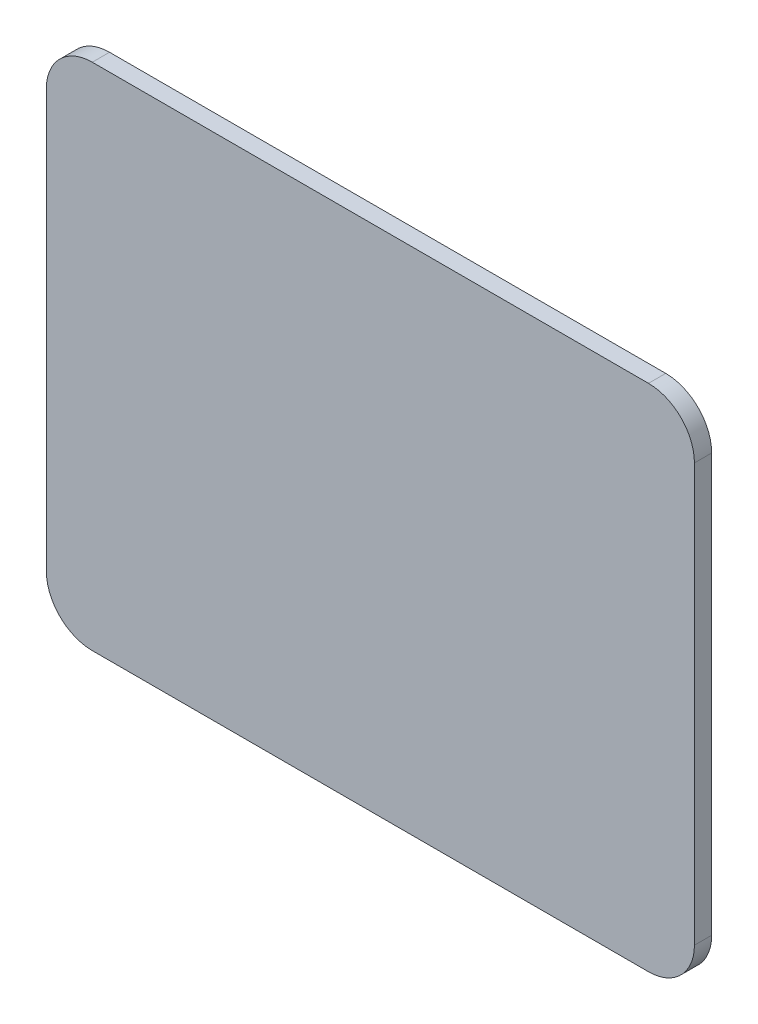
ISO-10303-21;
HEADER;
FILE_DESCRIPTION(('STEP AP214'),'2;1');
FILE_NAME('part.step','',(''),(''),'','','');
FILE_SCHEMA(('AUTOMOTIVE_DESIGN { 1 0 10303 214 1 1 1 1 }'));
ENDSEC;
DATA;
#1=APPLICATION_CONTEXT('core data for automotive mechanical design processes');
#2=APPLICATION_PROTOCOL_DEFINITION('international standard','automotive_design',2000,#1);
#3=PRODUCT_CONTEXT('',#1,'mechanical');
#4=PRODUCT('Part','Part','',(#3));
#5=PRODUCT_RELATED_PRODUCT_CATEGORY('part','',(#4));
#6=PRODUCT_DEFINITION_FORMATION('','',#4);
#7=PRODUCT_DEFINITION_CONTEXT('part definition',#1,'design');
#8=PRODUCT_DEFINITION('design','',#6,#7);
#9=PRODUCT_DEFINITION_SHAPE('','',#8);
#10=(LENGTH_UNIT() NAMED_UNIT(*) SI_UNIT(.MILLI.,.METRE.));
#11=(NAMED_UNIT(*) PLANE_ANGLE_UNIT() SI_UNIT($,.RADIAN.));
#12=(NAMED_UNIT(*) SI_UNIT($,.STERADIAN.) SOLID_ANGLE_UNIT());
#13=UNCERTAINTY_MEASURE_WITH_UNIT(LENGTH_MEASURE(1.E-05),#10,'distance_accuracy_value','');
#14=(GEOMETRIC_REPRESENTATION_CONTEXT(3) GLOBAL_UNCERTAINTY_ASSIGNED_CONTEXT((#13)) GLOBAL_UNIT_ASSIGNED_CONTEXT((#10,
#11,#12)) REPRESENTATION_CONTEXT('',''));
#15=CARTESIAN_POINT('',(0.,0.,0.));
#16=DIRECTION('',(0.,0.,1.));
#17=DIRECTION('',(1.,0.,0.));
#18=AXIS2_PLACEMENT_3D('',#15,#16,#17);
#19=CARTESIAN_POINT('',(234.35,26.,6.));
#20=DIRECTION('',(0.,0.,-1.));
#21=DIRECTION('',(-1.,0.,0.));
#22=AXIS2_PLACEMENT_3D('',#19,#20,#21);
#23=CYLINDRICAL_SURFACE('',#22,16.);
#24=CARTESIAN_POINT('',(234.35,26.,0.));
#25=DIRECTION('',(0.,0.,1.));
#26=DIRECTION('',(1.,0.,0.));
#27=AXIS2_PLACEMENT_3D('',#24,#25,#26);
#28=CIRCLE('',#27,16.);
#29=CARTESIAN_POINT('',(234.35,9.99999999999997,0.));
#30=VERTEX_POINT('',#29);
#31=CARTESIAN_POINT('',(250.35,26.,0.));
#32=VERTEX_POINT('',#31);
#33=EDGE_CURVE('E157',#30,#32,#28,.T.);
#34=ORIENTED_EDGE('',*,*,#33,.T.);
#35=DIRECTION('',(0.,0.,-1.));
#36=VECTOR('',#35,1.);
#37=CARTESIAN_POINT('',(250.35,26.,6.));
#38=LINE('',#37,#36);
#39=CARTESIAN_POINT('',(250.35,26.,6.));
#40=VERTEX_POINT('',#39);
#41=EDGE_CURVE('E11',#40,#32,#38,.T.);
#42=ORIENTED_EDGE('',*,*,#41,.F.);
#43=CARTESIAN_POINT('',(234.35,26.,6.));
#44=DIRECTION('',(0.,0.,1.));
#45=DIRECTION('',(1.,0.,0.));
#46=AXIS2_PLACEMENT_3D('',#43,#44,#45);
#47=CIRCLE('',#46,16.);
#48=CARTESIAN_POINT('',(234.35,9.99999999999997,6.));
#49=VERTEX_POINT('',#48);
#50=EDGE_CURVE('E179',#49,#40,#47,.T.);
#51=ORIENTED_EDGE('',*,*,#50,.F.);
#52=DIRECTION('',(0.,0.,-1.));
#53=VECTOR('',#52,1.);
#54=CARTESIAN_POINT('',(234.35,9.99999999999997,6.));
#55=LINE('',#54,#53);
#56=EDGE_CURVE('E153',#49,#30,#55,.T.);
#57=ORIENTED_EDGE('',*,*,#56,.T.);
#58=EDGE_LOOP('',(#34,#42,#51,#57));
#59=FACE_BOUND('',#58,.T.);
#60=ADVANCED_FACE('F41',(#59),#23,.T.);
#61=CARTESIAN_POINT('',(250.35,26.,6.));
#62=DIRECTION('',(-1.,0.,0.));
#63=DIRECTION('',(0.,0.,1.));
#64=AXIS2_PLACEMENT_3D('',#61,#62,#63);
#65=PLANE('',#64);
#66=DIRECTION('',(0.,1.,0.));
#67=VECTOR('',#66,1.);
#68=CARTESIAN_POINT('',(250.35,26.,0.));
#69=LINE('',#68,#67);
#70=CARTESIAN_POINT('',(250.35,171.4,0.));
#71=VERTEX_POINT('',#70);
#72=EDGE_CURVE('E161',#32,#71,#69,.T.);
#73=ORIENTED_EDGE('',*,*,#72,.T.);
#74=DIRECTION('',(0.,0.,-1.));
#75=VECTOR('',#74,1.);
#76=CARTESIAN_POINT('',(250.35,171.4,6.));
#77=LINE('',#76,#75);
#78=CARTESIAN_POINT('',(250.35,171.4,6.));
#79=VERTEX_POINT('',#78);
#80=EDGE_CURVE('E50',#79,#71,#77,.T.);
#81=ORIENTED_EDGE('',*,*,#80,.F.);
#82=DIRECTION('',(0.,1.,0.));
#83=VECTOR('',#82,1.);
#84=CARTESIAN_POINT('',(250.35,26.,6.));
#85=LINE('',#84,#83);
#86=EDGE_CURVE('E112',#40,#79,#85,.T.);
#87=ORIENTED_EDGE('',*,*,#86,.F.);
#88=ORIENTED_EDGE('',*,*,#41,.T.);
#89=EDGE_LOOP('',(#73,#81,#87,#88));
#90=FACE_BOUND('',#89,.T.);
#91=ADVANCED_FACE('F224',(#90),#65,.F.);
#92=CARTESIAN_POINT('',(234.35,171.4,6.));
#93=DIRECTION('',(0.,0.,-1.));
#94=DIRECTION('',(-1.,0.,0.));
#95=AXIS2_PLACEMENT_3D('',#92,#93,#94);
#96=CYLINDRICAL_SURFACE('',#95,16.);
#97=CARTESIAN_POINT('',(234.35,171.4,0.));
#98=DIRECTION('',(0.,0.,1.));
#99=DIRECTION('',(1.,0.,0.));
#100=AXIS2_PLACEMENT_3D('',#97,#98,#99);
#101=CIRCLE('',#100,16.);
#102=CARTESIAN_POINT('',(234.35,187.4,0.));
#103=VERTEX_POINT('',#102);
#104=EDGE_CURVE('E164',#71,#103,#101,.T.);
#105=ORIENTED_EDGE('',*,*,#104,.T.);
#106=DIRECTION('',(0.,0.,-1.));
#107=VECTOR('',#106,1.);
#108=CARTESIAN_POINT('',(234.35,187.4,6.));
#109=LINE('',#108,#107);
#110=CARTESIAN_POINT('',(234.35,187.4,6.));
#111=VERTEX_POINT('',#110);
#112=EDGE_CURVE('E189',#111,#103,#109,.T.);
#113=ORIENTED_EDGE('',*,*,#112,.F.);
#114=CARTESIAN_POINT('',(234.35,171.4,6.));
#115=DIRECTION('',(0.,0.,1.));
#116=DIRECTION('',(1.,0.,0.));
#117=AXIS2_PLACEMENT_3D('',#114,#115,#116);
#118=CIRCLE('',#117,16.);
#119=EDGE_CURVE('E199',#79,#111,#118,.T.);
#120=ORIENTED_EDGE('',*,*,#119,.F.);
#121=ORIENTED_EDGE('',*,*,#80,.T.);
#122=EDGE_LOOP('',(#105,#113,#120,#121));
#123=FACE_BOUND('',#122,.T.);
#124=ADVANCED_FACE('F197',(#123),#96,.T.);
#125=CARTESIAN_POINT('',(234.35,187.4,6.));
#126=DIRECTION('',(0.,-1.,0.));
#127=DIRECTION('',(0.,0.,-1.));
#128=AXIS2_PLACEMENT_3D('',#125,#126,#127);
#129=PLANE('',#128);
#130=DIRECTION('',(-1.,0.,0.));
#131=VECTOR('',#130,1.);
#132=CARTESIAN_POINT('',(234.35,187.4,0.));
#133=LINE('',#132,#131);
#134=CARTESIAN_POINT('',(40.7312662157985,187.4,0.));
#135=VERTEX_POINT('',#134);
#136=EDGE_CURVE('E167',#103,#135,#133,.T.);
#137=ORIENTED_EDGE('',*,*,#136,.T.);
#138=DIRECTION('',(0.,0.,-1.));
#139=VECTOR('',#138,1.);
#140=CARTESIAN_POINT('',(40.7312662157985,187.4,6.));
#141=LINE('',#140,#139);
#142=CARTESIAN_POINT('',(40.7312662157985,187.4,6.));
#143=VERTEX_POINT('',#142);
#144=EDGE_CURVE('E185',#143,#135,#141,.T.);
#145=ORIENTED_EDGE('',*,*,#144,.F.);
#146=DIRECTION('',(-1.,0.,0.));
#147=VECTOR('',#146,1.);
#148=CARTESIAN_POINT('',(234.35,187.4,6.));
#149=LINE('',#148,#147);
#150=EDGE_CURVE('E212',#111,#143,#149,.T.);
#151=ORIENTED_EDGE('',*,*,#150,.F.);
#152=ORIENTED_EDGE('',*,*,#112,.T.);
#153=EDGE_LOOP('',(#137,#145,#151,#152));
#154=FACE_BOUND('',#153,.T.);
#155=ADVANCED_FACE('F207',(#154),#129,.F.);
#156=CARTESIAN_POINT('',(40.7312662157985,171.4,6.));
#157=DIRECTION('',(0.,0.,-1.));
#158=DIRECTION('',(-1.,0.,0.));
#159=AXIS2_PLACEMENT_3D('',#156,#157,#158);
#160=CYLINDRICAL_SURFACE('',#159,16.);
#161=CARTESIAN_POINT('',(40.7312662157985,171.4,0.));
#162=DIRECTION('',(0.,0.,1.));
#163=DIRECTION('',(1.,0.,0.));
#164=AXIS2_PLACEMENT_3D('',#161,#162,#163);
#165=CIRCLE('',#164,16.);
#166=CARTESIAN_POINT('',(24.7312662157985,171.4,0.));
#167=VERTEX_POINT('',#166);
#168=EDGE_CURVE('E170',#135,#167,#165,.T.);
#169=ORIENTED_EDGE('',*,*,#168,.T.);
#170=DIRECTION('',(0.,0.,-1.));
#171=VECTOR('',#170,1.);
#172=CARTESIAN_POINT('',(24.7312662157985,171.4,6.));
#173=LINE('',#172,#171);
#174=CARTESIAN_POINT('',(24.7312662157985,171.4,6.));
#175=VERTEX_POINT('',#174);
#176=EDGE_CURVE('E145',#175,#167,#173,.T.);
#177=ORIENTED_EDGE('',*,*,#176,.F.);
#178=CARTESIAN_POINT('',(40.7312662157985,171.4,6.));
#179=DIRECTION('',(0.,0.,1.));
#180=DIRECTION('',(1.,0.,0.));
#181=AXIS2_PLACEMENT_3D('',#178,#179,#180);
#182=CIRCLE('',#181,16.);
#183=EDGE_CURVE('E134',#143,#175,#182,.T.);
#184=ORIENTED_EDGE('',*,*,#183,.F.);
#185=ORIENTED_EDGE('',*,*,#144,.T.);
#186=EDGE_LOOP('',(#169,#177,#184,#185));
#187=FACE_BOUND('',#186,.T.);
#188=ADVANCED_FACE('F210',(#187),#160,.T.);
#189=CARTESIAN_POINT('',(24.7312662157985,171.4,6.));
#190=DIRECTION('',(1.,0.,0.));
#191=DIRECTION('',(0.,0.,-1.));
#192=AXIS2_PLACEMENT_3D('',#189,#190,#191);
#193=PLANE('',#192);
#194=DIRECTION('',(0.,-1.,0.));
#195=VECTOR('',#194,1.);
#196=CARTESIAN_POINT('',(24.7312662157985,171.4,0.));
#197=LINE('',#196,#195);
#198=CARTESIAN_POINT('',(24.7312662157985,26.,0.));
#199=VERTEX_POINT('',#198);
#200=EDGE_CURVE('E143',#167,#199,#197,.T.);
#201=ORIENTED_EDGE('',*,*,#200,.T.);
#202=DIRECTION('',(0.,0.,-1.));
#203=VECTOR('',#202,1.);
#204=CARTESIAN_POINT('',(24.7312662157985,26.,6.));
#205=LINE('',#204,#203);
#206=CARTESIAN_POINT('',(24.7312662157985,26.,6.));
#207=VERTEX_POINT('',#206);
#208=EDGE_CURVE('E140',#207,#199,#205,.T.);
#209=ORIENTED_EDGE('',*,*,#208,.F.);
#210=DIRECTION('',(0.,-1.,0.));
#211=VECTOR('',#210,1.);
#212=CARTESIAN_POINT('',(24.7312662157985,171.4,6.));
#213=LINE('',#212,#211);
#214=EDGE_CURVE('E128',#175,#207,#213,.T.);
#215=ORIENTED_EDGE('',*,*,#214,.F.);
#216=ORIENTED_EDGE('',*,*,#176,.T.);
#217=EDGE_LOOP('',(#201,#209,#215,#216));
#218=FACE_BOUND('',#217,.T.);
#219=ADVANCED_FACE('F141',(#218),#193,.F.);
#220=CARTESIAN_POINT('',(40.7312662157985,26.,6.));
#221=DIRECTION('',(0.,0.,-1.));
#222=DIRECTION('',(-1.,0.,0.));
#223=AXIS2_PLACEMENT_3D('',#220,#221,#222);
#224=CYLINDRICAL_SURFACE('',#223,16.);
#225=CARTESIAN_POINT('',(40.7312662157985,26.,0.));
#226=DIRECTION('',(0.,0.,1.));
#227=DIRECTION('',(1.,0.,0.));
#228=AXIS2_PLACEMENT_3D('',#225,#226,#227);
#229=CIRCLE('',#228,16.);
#230=CARTESIAN_POINT('',(40.7312662157985,9.99999999999998,0.));
#231=VERTEX_POINT('',#230);
#232=EDGE_CURVE('E98',#199,#231,#229,.T.);
#233=ORIENTED_EDGE('',*,*,#232,.T.);
#234=DIRECTION('',(0.,0.,-1.));
#235=VECTOR('',#234,1.);
#236=CARTESIAN_POINT('',(40.7312662157985,9.99999999999998,6.));
#237=LINE('',#236,#235);
#238=CARTESIAN_POINT('',(40.7312662157985,9.99999999999998,6.));
#239=VERTEX_POINT('',#238);
#240=EDGE_CURVE('E146',#239,#231,#237,.T.);
#241=ORIENTED_EDGE('',*,*,#240,.F.);
#242=CARTESIAN_POINT('',(40.7312662157985,26.,6.));
#243=DIRECTION('',(0.,0.,1.));
#244=DIRECTION('',(1.,0.,0.));
#245=AXIS2_PLACEMENT_3D('',#242,#243,#244);
#246=CIRCLE('',#245,16.);
#247=EDGE_CURVE('E132',#207,#239,#246,.T.);
#248=ORIENTED_EDGE('',*,*,#247,.F.);
#249=ORIENTED_EDGE('',*,*,#208,.T.);
#250=EDGE_LOOP('',(#233,#241,#248,#249));
#251=FACE_BOUND('',#250,.T.);
#252=ADVANCED_FACE('F148',(#251),#224,.T.);
#253=CARTESIAN_POINT('',(40.7312662157985,9.99999999999998,6.));
#254=DIRECTION('',(0.,1.,0.));
#255=DIRECTION('',(-1.,0.,0.));
#256=AXIS2_PLACEMENT_3D('',#253,#254,#255);
#257=PLANE('',#256);
#258=DIRECTION('',(1.,0.,0.));
#259=VECTOR('',#258,1.);
#260=CARTESIAN_POINT('',(40.7312662157985,9.99999999999998,0.));
#261=LINE('',#260,#259);
#262=EDGE_CURVE('E104',#231,#30,#261,.T.);
#263=ORIENTED_EDGE('',*,*,#262,.T.);
#264=ORIENTED_EDGE('',*,*,#56,.F.);
#265=DIRECTION('',(1.,0.,0.));
#266=VECTOR('',#265,1.);
#267=CARTESIAN_POINT('',(40.7312662157985,9.99999999999998,6.));
#268=LINE('',#267,#266);
#269=EDGE_CURVE('E61',#239,#49,#268,.T.);
#270=ORIENTED_EDGE('',*,*,#269,.F.);
#271=ORIENTED_EDGE('',*,*,#240,.T.);
#272=EDGE_LOOP('',(#263,#264,#270,#271));
#273=FACE_BOUND('',#272,.T.);
#274=ADVANCED_FACE('F240',(#273),#257,.F.);
#275=CARTESIAN_POINT('',(234.35,26.,6.));
#276=DIRECTION('',(0.,0.,1.));
#277=DIRECTION('',(1.,0.,0.));
#278=AXIS2_PLACEMENT_3D('',#275,#276,#277);
#279=PLANE('',#278);
#280=ORIENTED_EDGE('',*,*,#50,.T.);
#281=ORIENTED_EDGE('',*,*,#86,.T.);
#282=ORIENTED_EDGE('',*,*,#119,.T.);
#283=ORIENTED_EDGE('',*,*,#150,.T.);
#284=ORIENTED_EDGE('',*,*,#183,.T.);
#285=ORIENTED_EDGE('',*,*,#214,.T.);
#286=ORIENTED_EDGE('',*,*,#247,.T.);
#287=ORIENTED_EDGE('',*,*,#269,.T.);
#288=EDGE_LOOP('',(#280,#281,#282,#283,#284,#285,#286,#287));
#289=FACE_BOUND('',#288,.T.);
#290=ADVANCED_FACE('F130',(#289),#279,.T.);
#291=CARTESIAN_POINT('',(234.35,26.,0.));
#292=DIRECTION('',(0.,0.,1.));
#293=DIRECTION('',(1.,0.,0.));
#294=AXIS2_PLACEMENT_3D('',#291,#292,#293);
#295=PLANE('',#294);
#296=ORIENTED_EDGE('',*,*,#33,.F.);
#297=ORIENTED_EDGE('',*,*,#262,.F.);
#298=ORIENTED_EDGE('',*,*,#232,.F.);
#299=ORIENTED_EDGE('',*,*,#200,.F.);
#300=ORIENTED_EDGE('',*,*,#168,.F.);
#301=ORIENTED_EDGE('',*,*,#136,.F.);
#302=ORIENTED_EDGE('',*,*,#104,.F.);
#303=ORIENTED_EDGE('',*,*,#72,.F.);
#304=EDGE_LOOP('',(#296,#297,#298,#299,#300,#301,#302,#303));
#305=FACE_BOUND('',#304,.T.);
#306=ADVANCED_FACE('F203',(#305),#295,.F.);
#307=CLOSED_SHELL('',(#60,#91,#124,#155,#188,#219,#252,#274,#290,#306));
#308=MANIFOLD_SOLID_BREP('B2',#307);
#309=ADVANCED_BREP_SHAPE_REPRESENTATION('',(#18,#308),#14);
#310=SHAPE_DEFINITION_REPRESENTATION(#9,#309);
ENDSEC;
END-ISO-10303-21;
